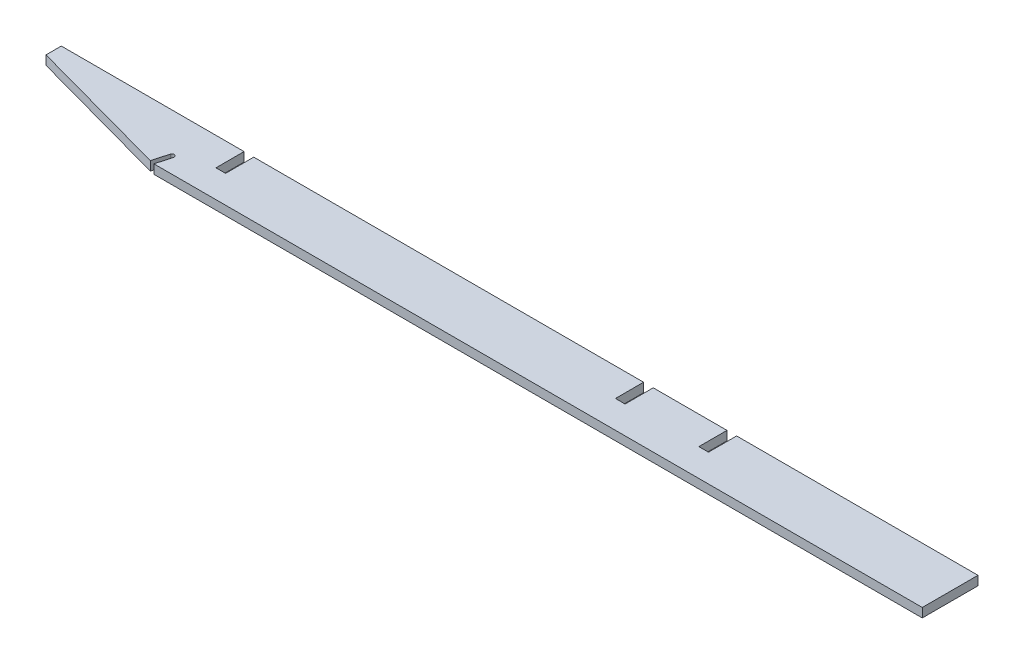
ISO-10303-21;
HEADER;
FILE_DESCRIPTION(('STEP AP214'),'2;1');
FILE_NAME('part.step','',(''),(''),'','','');
FILE_SCHEMA(('AUTOMOTIVE_DESIGN { 1 0 10303 214 1 1 1 1 }'));
ENDSEC;
DATA;
#1=APPLICATION_CONTEXT('core data for automotive mechanical design processes');
#2=APPLICATION_PROTOCOL_DEFINITION('international standard','automotive_design',2000,#1);
#3=PRODUCT_CONTEXT('',#1,'mechanical');
#4=PRODUCT('Part','Part','',(#3));
#5=PRODUCT_RELATED_PRODUCT_CATEGORY('part','',(#4));
#6=PRODUCT_DEFINITION_FORMATION('','',#4);
#7=PRODUCT_DEFINITION_CONTEXT('part definition',#1,'design');
#8=PRODUCT_DEFINITION('design','',#6,#7);
#9=PRODUCT_DEFINITION_SHAPE('','',#8);
#10=(LENGTH_UNIT() NAMED_UNIT(*) SI_UNIT(.MILLI.,.METRE.));
#11=(NAMED_UNIT(*) PLANE_ANGLE_UNIT() SI_UNIT($,.RADIAN.));
#12=(NAMED_UNIT(*) SI_UNIT($,.STERADIAN.) SOLID_ANGLE_UNIT());
#13=UNCERTAINTY_MEASURE_WITH_UNIT(LENGTH_MEASURE(1.E-05),#10,'distance_accuracy_value','');
#14=(GEOMETRIC_REPRESENTATION_CONTEXT(3) GLOBAL_UNCERTAINTY_ASSIGNED_CONTEXT((#13)) GLOBAL_UNIT_ASSIGNED_CONTEXT((#10,
#11,#12)) REPRESENTATION_CONTEXT('',''));
#15=CARTESIAN_POINT('',(0.,0.,0.));
#16=DIRECTION('',(0.,0.,1.));
#17=DIRECTION('',(1.,0.,0.));
#18=AXIS2_PLACEMENT_3D('',#15,#16,#17);
#19=CARTESIAN_POINT('',(-1457.76984888733,841.502,38.1));
#20=DIRECTION('',(-0.26471698178117,0.,0.964326147917118));
#21=DIRECTION('',(0.964326147917118,0.,0.26471698178117));
#22=AXIS2_PLACEMENT_3D('',#19,#20,#21);
#23=PLANE('',#22);
#24=DIRECTION('',(0.964326147917118,0.,0.26471698178117));
#25=VECTOR('',#24,1.);
#26=CARTESIAN_POINT('',(-1457.76984888733,841.502,38.1));
#27=LINE('',#26,#25);
#28=CARTESIAN_POINT('',(-1520.36270603019,841.502,20.9176470588235));
#29=VERTEX_POINT('',#28);
#30=CARTESIAN_POINT('',(-1323.73398806948,841.502,74.8941578715673));
#31=VERTEX_POINT('',#30);
#32=EDGE_CURVE('E296',#29,#31,#27,.T.);
#33=ORIENTED_EDGE('',*,*,#32,.T.);
#34=DIRECTION('',(0.,1.,0.));
#35=VECTOR('',#34,1.);
#36=CARTESIAN_POINT('',(-1323.73398806948,-2244.13415908109,74.8941578715673));
#37=LINE('',#36,#35);
#38=CARTESIAN_POINT('',(-1323.73398806948,853.948,74.8941578715673));
#39=VERTEX_POINT('',#38);
#40=EDGE_CURVE('E199',#31,#39,#37,.T.);
#41=ORIENTED_EDGE('',*,*,#40,.T.);
#42=DIRECTION('',(0.964326147917118,0.,0.26471698178117));
#43=VECTOR('',#42,1.);
#44=CARTESIAN_POINT('',(-1457.76984888733,853.948,38.1));
#45=LINE('',#44,#43);
#46=CARTESIAN_POINT('',(-1520.36270603019,853.948,20.9176470588235));
#47=VERTEX_POINT('',#46);
#48=EDGE_CURVE('E295',#47,#39,#45,.T.);
#49=ORIENTED_EDGE('',*,*,#48,.F.);
#50=DIRECTION('',(0.,-1.,0.));
#51=VECTOR('',#50,1.);
#52=CARTESIAN_POINT('',(-1520.36270603019,841.502,20.9176470588235));
#53=LINE('',#52,#51);
#54=EDGE_CURVE('E47',#47,#29,#53,.T.);
#55=ORIENTED_EDGE('',*,*,#54,.T.);
#56=EDGE_LOOP('',(#33,#41,#49,#55));
#57=FACE_BOUND('',#56,.T.);
#58=ADVANCED_FACE('F14',(#57),#23,.T.);
#59=CARTESIAN_POINT('',(-269.875,841.502,76.2));
#60=DIRECTION('',(0.,0.,-1.));
#61=DIRECTION('',(-1.,0.,0.));
#62=AXIS2_PLACEMENT_3D('',#59,#60,#61);
#63=PLANE('',#62);
#64=DIRECTION('',(0.,1.,0.));
#65=VECTOR('',#64,1.);
#66=CARTESIAN_POINT('',(-1317.50754546389,841.502,76.2));
#67=LINE('',#66,#65);
#68=CARTESIAN_POINT('',(-1317.50754546389,841.502,76.2));
#69=VERTEX_POINT('',#68);
#70=CARTESIAN_POINT('',(-1317.50754546389,853.948,76.2));
#71=VERTEX_POINT('',#70);
#72=EDGE_CURVE('E219',#69,#71,#67,.T.);
#73=ORIENTED_EDGE('',*,*,#72,.F.);
#74=DIRECTION('',(-1.,0.,0.));
#75=VECTOR('',#74,1.);
#76=CARTESIAN_POINT('',(-269.875,841.502,76.2));
#77=LINE('',#76,#75);
#78=CARTESIAN_POINT('',(-266.7,841.502,76.2));
#79=VERTEX_POINT('',#78);
#80=EDGE_CURVE('E310',#79,#69,#77,.T.);
#81=ORIENTED_EDGE('',*,*,#80,.F.);
#82=DIRECTION('',(0.,1.,0.));
#83=VECTOR('',#82,1.);
#84=CARTESIAN_POINT('',(-266.7,841.502,76.2));
#85=LINE('',#84,#83);
#86=CARTESIAN_POINT('',(-266.7,853.948,76.2));
#87=VERTEX_POINT('',#86);
#88=EDGE_CURVE('E313',#79,#87,#85,.T.);
#89=ORIENTED_EDGE('',*,*,#88,.T.);
#90=DIRECTION('',(-1.,0.,0.));
#91=VECTOR('',#90,1.);
#92=CARTESIAN_POINT('',(-269.875,853.948,76.2));
#93=LINE('',#92,#91);
#94=EDGE_CURVE('E300',#87,#71,#93,.T.);
#95=ORIENTED_EDGE('',*,*,#94,.T.);
#96=EDGE_LOOP('',(#73,#81,#89,#95));
#97=FACE_BOUND('',#96,.T.);
#98=ADVANCED_FACE('F402',(#97),#63,.F.);
#99=CARTESIAN_POINT('',(-931.631353015096,841.502,38.1));
#100=DIRECTION('',(0.,-1.,0.));
#101=DIRECTION('',(1.,0.,0.));
#102=AXIS2_PLACEMENT_3D('',#99,#100,#101);
#103=PLANE('',#102);
#104=ORIENTED_EDGE('',*,*,#80,.T.);
#105=DIRECTION('',(0.26471698178117,0.,-0.964326147917118));
#106=VECTOR('',#105,1.);
#107=CARTESIAN_POINT('',(-1280.74131960763,841.502,-57.7341084763812));
#108=LINE('',#107,#106);
#109=CARTESIAN_POINT('',(-1311.72718211012,841.502,55.1429620684198));
#110=VERTEX_POINT('',#109);
#111=EDGE_CURVE('E217',#69,#110,#108,.T.);
#112=ORIENTED_EDGE('',*,*,#111,.T.);
#113=CARTESIAN_POINT('',(-1314.78891762976,841.502,54.3024856512645));
#114=DIRECTION('',(0.,-1.,0.));
#115=DIRECTION('',(0.,0.,-1.));
#116=AXIS2_PLACEMENT_3D('',#113,#114,#115);
#117=CIRCLE('',#116,3.175);
#118=CARTESIAN_POINT('',(-1317.8506531494,841.502,53.4620092341093));
#119=VERTEX_POINT('',#118);
#120=EDGE_CURVE('E203',#119,#110,#117,.T.);
#121=ORIENTED_EDGE('',*,*,#120,.F.);
#122=DIRECTION('',(0.26471698178117,0.,-0.964326147917118));
#123=VECTOR('',#122,1.);
#124=CARTESIAN_POINT('',(-1286.8647906469,841.502,-59.4150613106916));
#125=LINE('',#124,#123);
#126=EDGE_CURVE('E196',#31,#119,#125,.T.);
#127=ORIENTED_EDGE('',*,*,#126,.F.);
#128=ORIENTED_EDGE('',*,*,#32,.F.);
#129=DIRECTION('',(0.,0.,1.));
#130=VECTOR('',#129,1.);
#131=CARTESIAN_POINT('',(-1520.36270603019,841.502,38.1));
#132=LINE('',#131,#130);
#133=CARTESIAN_POINT('',(-1520.36270603019,841.502,0.));
#134=VERTEX_POINT('',#133);
#135=EDGE_CURVE('E380',#29,#134,#132,.F.);
#136=ORIENTED_EDGE('',*,*,#135,.T.);
#137=DIRECTION('',(-1.,0.,0.));
#138=VECTOR('',#137,1.);
#139=CARTESIAN_POINT('',(-931.631353015096,841.502,0.));
#140=LINE('',#139,#138);
#141=CARTESIAN_POINT('',(-1270.381,841.502,0.));
#142=VERTEX_POINT('',#141);
#143=EDGE_CURVE('E299',#142,#134,#140,.T.);
#144=ORIENTED_EDGE('',*,*,#143,.F.);
#145=DIRECTION('',(0.,0.,-1.));
#146=VECTOR('',#145,1.);
#147=CARTESIAN_POINT('',(-1270.381,841.502,38.1));
#148=LINE('',#147,#146);
#149=CARTESIAN_POINT('',(-1270.381,841.502,38.481));
#150=VERTEX_POINT('',#149);
#151=EDGE_CURVE('E262',#150,#142,#148,.T.);
#152=ORIENTED_EDGE('',*,*,#151,.F.);
#153=DIRECTION('',(-1.,0.,0.));
#154=VECTOR('',#153,1.);
#155=CARTESIAN_POINT('',(-931.631353015096,841.502,38.481));
#156=LINE('',#155,#154);
#157=CARTESIAN_POINT('',(-1257.173,841.502,38.481));
#158=VERTEX_POINT('',#157);
#159=EDGE_CURVE('E256',#158,#150,#156,.T.);
#160=ORIENTED_EDGE('',*,*,#159,.F.);
#161=DIRECTION('',(0.,0.,1.));
#162=VECTOR('',#161,1.);
#163=CARTESIAN_POINT('',(-1257.173,841.502,38.1));
#164=LINE('',#163,#162);
#165=CARTESIAN_POINT('',(-1257.173,841.502,0.));
#166=VERTEX_POINT('',#165);
#167=EDGE_CURVE('E253',#166,#158,#164,.T.);
#168=ORIENTED_EDGE('',*,*,#167,.F.);
#169=CARTESIAN_POINT('',(-724.027,841.502,0.));
#170=VERTEX_POINT('',#169);
#171=EDGE_CURVE('E455',#170,#166,#140,.T.);
#172=ORIENTED_EDGE('',*,*,#171,.F.);
#173=DIRECTION('',(0.,0.,-1.));
#174=VECTOR('',#173,1.);
#175=CARTESIAN_POINT('',(-724.027,841.502,38.1));
#176=LINE('',#175,#174);
#177=CARTESIAN_POINT('',(-724.027,841.502,38.481));
#178=VERTEX_POINT('',#177);
#179=EDGE_CURVE('E277',#178,#170,#176,.T.);
#180=ORIENTED_EDGE('',*,*,#179,.F.);
#181=DIRECTION('',(-1.,0.,0.));
#182=VECTOR('',#181,1.);
#183=CARTESIAN_POINT('',(-931.631353015096,841.502,38.481));
#184=LINE('',#183,#182);
#185=CARTESIAN_POINT('',(-710.819,841.502,38.481));
#186=VERTEX_POINT('',#185);
#187=EDGE_CURVE('E271',#186,#178,#184,.T.);
#188=ORIENTED_EDGE('',*,*,#187,.F.);
#189=DIRECTION('',(0.,0.,1.));
#190=VECTOR('',#189,1.);
#191=CARTESIAN_POINT('',(-710.819,841.502,38.1));
#192=LINE('',#191,#190);
#193=CARTESIAN_POINT('',(-710.819,841.502,0.));
#194=VERTEX_POINT('',#193);
#195=EDGE_CURVE('E268',#194,#186,#192,.T.);
#196=ORIENTED_EDGE('',*,*,#195,.F.);
#197=CARTESIAN_POINT('',(-609.981,841.502,0.));
#198=VERTEX_POINT('',#197);
#199=EDGE_CURVE('E306',#198,#194,#140,.T.);
#200=ORIENTED_EDGE('',*,*,#199,.F.);
#201=DIRECTION('',(0.,0.,-1.));
#202=VECTOR('',#201,1.);
#203=CARTESIAN_POINT('',(-609.981,841.502,38.1));
#204=LINE('',#203,#202);
#205=CARTESIAN_POINT('',(-609.981,841.502,38.481));
#206=VERTEX_POINT('',#205);
#207=EDGE_CURVE('E283',#206,#198,#204,.T.);
#208=ORIENTED_EDGE('',*,*,#207,.F.);
#209=DIRECTION('',(-1.,0.,0.));
#210=VECTOR('',#209,1.);
#211=CARTESIAN_POINT('',(-931.631353015096,841.502,38.481));
#212=LINE('',#211,#210);
#213=CARTESIAN_POINT('',(-596.773,841.502,38.481));
#214=VERTEX_POINT('',#213);
#215=EDGE_CURVE('E292',#214,#206,#212,.T.);
#216=ORIENTED_EDGE('',*,*,#215,.F.);
#217=DIRECTION('',(0.,0.,1.));
#218=VECTOR('',#217,1.);
#219=CARTESIAN_POINT('',(-596.773,841.502,38.1));
#220=LINE('',#219,#218);
#221=CARTESIAN_POINT('',(-596.773,841.502,0.));
#222=VERTEX_POINT('',#221);
#223=EDGE_CURVE('E289',#222,#214,#220,.T.);
#224=ORIENTED_EDGE('',*,*,#223,.F.);
#225=CARTESIAN_POINT('',(-266.7,841.502,0.));
#226=VERTEX_POINT('',#225);
#227=EDGE_CURVE('E301',#226,#222,#140,.T.);
#228=ORIENTED_EDGE('',*,*,#227,.F.);
#229=DIRECTION('',(0.,0.,-1.));
#230=VECTOR('',#229,1.);
#231=CARTESIAN_POINT('',(-266.7,841.502,38.1));
#232=LINE('',#231,#230);
#233=EDGE_CURVE('E305',#79,#226,#232,.T.);
#234=ORIENTED_EDGE('',*,*,#233,.F.);
#235=EDGE_LOOP('',(#104,#112,#121,#127,#128,#136,#144,#152,#160,#168,#172,#180,#188,#196,#200,
#208,#216,#224,#228,#234));
#236=FACE_BOUND('',#235,.T.);
#237=ADVANCED_FACE('F216',(#236),#103,.T.);
#238=CARTESIAN_POINT('',(-931.631353015096,853.948,38.1));
#239=DIRECTION('',(0.,-1.,0.));
#240=DIRECTION('',(1.,0.,0.));
#241=AXIS2_PLACEMENT_3D('',#238,#239,#240);
#242=PLANE('',#241);
#243=DIRECTION('',(0.26471698178117,0.,-0.964326147917118));
#244=VECTOR('',#243,1.);
#245=CARTESIAN_POINT('',(-1280.74131960763,853.948,-57.7341084763812));
#246=LINE('',#245,#244);
#247=CARTESIAN_POINT('',(-1311.72718211012,853.948,55.1429620684198));
#248=VERTEX_POINT('',#247);
#249=EDGE_CURVE('E9',#71,#248,#246,.T.);
#250=ORIENTED_EDGE('',*,*,#249,.F.);
#251=ORIENTED_EDGE('',*,*,#94,.F.);
#252=DIRECTION('',(0.,0.,-1.));
#253=VECTOR('',#252,1.);
#254=CARTESIAN_POINT('',(-266.7,853.948,38.1));
#255=LINE('',#254,#253);
#256=CARTESIAN_POINT('',(-266.7,853.948,0.));
#257=VERTEX_POINT('',#256);
#258=EDGE_CURVE('E322',#87,#257,#255,.T.);
#259=ORIENTED_EDGE('',*,*,#258,.T.);
#260=DIRECTION('',(-1.,0.,0.));
#261=VECTOR('',#260,1.);
#262=CARTESIAN_POINT('',(-931.631353015096,853.948,0.));
#263=LINE('',#262,#261);
#264=CARTESIAN_POINT('',(-596.773,853.948,0.));
#265=VERTEX_POINT('',#264);
#266=EDGE_CURVE('E318',#257,#265,#263,.T.);
#267=ORIENTED_EDGE('',*,*,#266,.T.);
#268=DIRECTION('',(0.,0.,1.));
#269=VECTOR('',#268,1.);
#270=CARTESIAN_POINT('',(-596.773,853.948,38.1));
#271=LINE('',#270,#269);
#272=CARTESIAN_POINT('',(-596.773,853.948,38.481));
#273=VERTEX_POINT('',#272);
#274=EDGE_CURVE('E367',#265,#273,#271,.T.);
#275=ORIENTED_EDGE('',*,*,#274,.T.);
#276=DIRECTION('',(-1.,0.,0.));
#277=VECTOR('',#276,1.);
#278=CARTESIAN_POINT('',(-931.631353015096,853.948,38.481));
#279=LINE('',#278,#277);
#280=CARTESIAN_POINT('',(-609.981,853.948,38.481));
#281=VERTEX_POINT('',#280);
#282=EDGE_CURVE('E363',#273,#281,#279,.T.);
#283=ORIENTED_EDGE('',*,*,#282,.T.);
#284=DIRECTION('',(0.,0.,-1.));
#285=VECTOR('',#284,1.);
#286=CARTESIAN_POINT('',(-609.981,853.948,38.1));
#287=LINE('',#286,#285);
#288=CARTESIAN_POINT('',(-609.981,853.948,0.));
#289=VERTEX_POINT('',#288);
#290=EDGE_CURVE('E359',#281,#289,#287,.T.);
#291=ORIENTED_EDGE('',*,*,#290,.T.);
#292=CARTESIAN_POINT('',(-710.819,853.948,0.));
#293=VERTEX_POINT('',#292);
#294=EDGE_CURVE('E323',#289,#293,#263,.T.);
#295=ORIENTED_EDGE('',*,*,#294,.T.);
#296=DIRECTION('',(0.,0.,1.));
#297=VECTOR('',#296,1.);
#298=CARTESIAN_POINT('',(-710.819,853.948,38.1));
#299=LINE('',#298,#297);
#300=CARTESIAN_POINT('',(-710.819,853.948,38.481));
#301=VERTEX_POINT('',#300);
#302=EDGE_CURVE('E347',#293,#301,#299,.T.);
#303=ORIENTED_EDGE('',*,*,#302,.T.);
#304=DIRECTION('',(-1.,0.,0.));
#305=VECTOR('',#304,1.);
#306=CARTESIAN_POINT('',(-931.631353015096,853.948,38.481));
#307=LINE('',#306,#305);
#308=CARTESIAN_POINT('',(-724.027,853.948,38.481));
#309=VERTEX_POINT('',#308);
#310=EDGE_CURVE('E351',#301,#309,#307,.T.);
#311=ORIENTED_EDGE('',*,*,#310,.T.);
#312=DIRECTION('',(0.,0.,-1.));
#313=VECTOR('',#312,1.);
#314=CARTESIAN_POINT('',(-724.027,853.948,38.1));
#315=LINE('',#314,#313);
#316=CARTESIAN_POINT('',(-724.027,853.948,0.));
#317=VERTEX_POINT('',#316);
#318=EDGE_CURVE('E355',#309,#317,#315,.T.);
#319=ORIENTED_EDGE('',*,*,#318,.T.);
#320=CARTESIAN_POINT('',(-1257.173,853.948,0.));
#321=VERTEX_POINT('',#320);
#322=EDGE_CURVE('E432',#317,#321,#263,.T.);
#323=ORIENTED_EDGE('',*,*,#322,.T.);
#324=DIRECTION('',(0.,0.,1.));
#325=VECTOR('',#324,1.);
#326=CARTESIAN_POINT('',(-1257.173,853.948,38.1));
#327=LINE('',#326,#325);
#328=CARTESIAN_POINT('',(-1257.173,853.948,38.481));
#329=VERTEX_POINT('',#328);
#330=EDGE_CURVE('E335',#321,#329,#327,.T.);
#331=ORIENTED_EDGE('',*,*,#330,.T.);
#332=DIRECTION('',(-1.,0.,0.));
#333=VECTOR('',#332,1.);
#334=CARTESIAN_POINT('',(-931.631353015096,853.948,38.481));
#335=LINE('',#334,#333);
#336=CARTESIAN_POINT('',(-1270.381,853.948,38.481));
#337=VERTEX_POINT('',#336);
#338=EDGE_CURVE('E339',#329,#337,#335,.T.);
#339=ORIENTED_EDGE('',*,*,#338,.T.);
#340=DIRECTION('',(0.,0.,-1.));
#341=VECTOR('',#340,1.);
#342=CARTESIAN_POINT('',(-1270.381,853.948,38.1));
#343=LINE('',#342,#341);
#344=CARTESIAN_POINT('',(-1270.381,853.948,0.));
#345=VERTEX_POINT('',#344);
#346=EDGE_CURVE('E343',#337,#345,#343,.T.);
#347=ORIENTED_EDGE('',*,*,#346,.T.);
#348=CARTESIAN_POINT('',(-1520.36270603019,853.948,0.));
#349=VERTEX_POINT('',#348);
#350=EDGE_CURVE('E317',#345,#349,#263,.T.);
#351=ORIENTED_EDGE('',*,*,#350,.T.);
#352=DIRECTION('',(0.,0.,-1.));
#353=VECTOR('',#352,1.);
#354=CARTESIAN_POINT('',(-1520.36270603019,853.948,0.));
#355=LINE('',#354,#353);
#356=EDGE_CURVE('E375',#349,#47,#355,.F.);
#357=ORIENTED_EDGE('',*,*,#356,.T.);
#358=ORIENTED_EDGE('',*,*,#48,.T.);
#359=DIRECTION('',(0.26471698178117,0.,-0.964326147917118));
#360=VECTOR('',#359,1.);
#361=CARTESIAN_POINT('',(-1286.8647906469,853.948,-59.4150613106916));
#362=LINE('',#361,#360);
#363=CARTESIAN_POINT('',(-1317.8506531494,853.948,53.4620092341093));
#364=VERTEX_POINT('',#363);
#365=EDGE_CURVE('E383',#39,#364,#362,.T.);
#366=ORIENTED_EDGE('',*,*,#365,.T.);
#367=CARTESIAN_POINT('',(-1314.78891762976,853.948,54.3024856512645));
#368=DIRECTION('',(0.,-1.,0.));
#369=DIRECTION('',(0.,0.,-1.));
#370=AXIS2_PLACEMENT_3D('',#367,#368,#369);
#371=CIRCLE('',#370,3.175);
#372=EDGE_CURVE('E23',#364,#248,#371,.T.);
#373=ORIENTED_EDGE('',*,*,#372,.T.);
#374=EDGE_LOOP('',(#250,#251,#259,#267,#275,#283,#291,#295,#303,#311,#319,#323,#331,#339,#347,
#351,#357,#358,#366,#373));
#375=FACE_BOUND('',#374,.T.);
#376=ADVANCED_FACE('F389',(#375),#242,.F.);
#377=CARTESIAN_POINT('',(-931.631353015096,841.502,0.));
#378=DIRECTION('',(0.,0.,-1.));
#379=DIRECTION('',(-1.,0.,0.));
#380=AXIS2_PLACEMENT_3D('',#377,#378,#379);
#381=PLANE('',#380);
#382=DIRECTION('',(0.,-1.,0.));
#383=VECTOR('',#382,1.);
#384=CARTESIAN_POINT('',(-596.773,841.502,0.));
#385=LINE('',#384,#383);
#386=EDGE_CURVE('E286',#265,#222,#385,.T.);
#387=ORIENTED_EDGE('',*,*,#386,.F.);
#388=ORIENTED_EDGE('',*,*,#266,.F.);
#389=DIRECTION('',(0.,1.,0.));
#390=VECTOR('',#389,1.);
#391=CARTESIAN_POINT('',(-266.7,841.502,0.));
#392=LINE('',#391,#390);
#393=EDGE_CURVE('E332',#226,#257,#392,.T.);
#394=ORIENTED_EDGE('',*,*,#393,.F.);
#395=ORIENTED_EDGE('',*,*,#227,.T.);
#396=EDGE_LOOP('',(#387,#388,#394,#395));
#397=FACE_BOUND('',#396,.T.);
#398=ADVANCED_FACE('F412',(#397),#381,.T.);
#399=DIRECTION('',(0.,1.,0.));
#400=VECTOR('',#399,1.);
#401=CARTESIAN_POINT('',(-724.027,841.502,0.));
#402=LINE('',#401,#400);
#403=EDGE_CURVE('E274',#170,#317,#402,.T.);
#404=ORIENTED_EDGE('',*,*,#403,.F.);
#405=ORIENTED_EDGE('',*,*,#171,.T.);
#406=DIRECTION('',(0.,-1.,0.));
#407=VECTOR('',#406,1.);
#408=CARTESIAN_POINT('',(-1257.173,841.502,0.));
#409=LINE('',#408,#407);
#410=EDGE_CURVE('E238',#321,#166,#409,.T.);
#411=ORIENTED_EDGE('',*,*,#410,.F.);
#412=ORIENTED_EDGE('',*,*,#322,.F.);
#413=EDGE_LOOP('',(#404,#405,#411,#412));
#414=FACE_BOUND('',#413,.T.);
#415=ADVANCED_FACE('F477',(#414),#381,.T.);
#416=ORIENTED_EDGE('',*,*,#143,.T.);
#417=DIRECTION('',(0.,1.,0.));
#418=VECTOR('',#417,1.);
#419=CARTESIAN_POINT('',(-1520.36270603019,841.502,0.));
#420=LINE('',#419,#418);
#421=EDGE_CURVE('E371',#134,#349,#420,.T.);
#422=ORIENTED_EDGE('',*,*,#421,.T.);
#423=ORIENTED_EDGE('',*,*,#350,.F.);
#424=DIRECTION('',(0.,1.,0.));
#425=VECTOR('',#424,1.);
#426=CARTESIAN_POINT('',(-1270.381,841.502,0.));
#427=LINE('',#426,#425);
#428=EDGE_CURVE('E259',#142,#345,#427,.T.);
#429=ORIENTED_EDGE('',*,*,#428,.F.);
#430=EDGE_LOOP('',(#416,#422,#423,#429));
#431=FACE_BOUND('',#430,.T.);
#432=ADVANCED_FACE('F448',(#431),#381,.T.);
#433=DIRECTION('',(0.,1.,0.));
#434=VECTOR('',#433,1.);
#435=CARTESIAN_POINT('',(-609.981,841.502,0.));
#436=LINE('',#435,#434);
#437=EDGE_CURVE('E280',#198,#289,#436,.T.);
#438=ORIENTED_EDGE('',*,*,#437,.F.);
#439=ORIENTED_EDGE('',*,*,#199,.T.);
#440=DIRECTION('',(0.,-1.,0.));
#441=VECTOR('',#440,1.);
#442=CARTESIAN_POINT('',(-710.819,841.502,0.));
#443=LINE('',#442,#441);
#444=EDGE_CURVE('E265',#293,#194,#443,.T.);
#445=ORIENTED_EDGE('',*,*,#444,.F.);
#446=ORIENTED_EDGE('',*,*,#294,.F.);
#447=EDGE_LOOP('',(#438,#439,#445,#446));
#448=FACE_BOUND('',#447,.T.);
#449=ADVANCED_FACE('F429',(#448),#381,.T.);
#450=CARTESIAN_POINT('',(-266.7,841.502,38.1));
#451=DIRECTION('',(1.,0.,0.));
#452=DIRECTION('',(0.,0.,-1.));
#453=AXIS2_PLACEMENT_3D('',#450,#451,#452);
#454=PLANE('',#453);
#455=ORIENTED_EDGE('',*,*,#258,.F.);
#456=ORIENTED_EDGE('',*,*,#88,.F.);
#457=ORIENTED_EDGE('',*,*,#233,.T.);
#458=ORIENTED_EDGE('',*,*,#393,.T.);
#459=EDGE_LOOP('',(#455,#456,#457,#458));
#460=FACE_BOUND('',#459,.T.);
#461=ADVANCED_FACE('F408',(#460),#454,.T.);
#462=CARTESIAN_POINT('',(-936.879,-2244.46058781173,38.481));
#463=DIRECTION('',(0.,0.,1.));
#464=DIRECTION('',(1.,0.,0.));
#465=AXIS2_PLACEMENT_3D('',#462,#463,#464);
#466=PLANE('',#465);
#467=ORIENTED_EDGE('',*,*,#159,.T.);
#468=DIRECTION('',(0.,1.,0.));
#469=VECTOR('',#468,1.);
#470=CARTESIAN_POINT('',(-1270.381,-2244.46058781173,38.481));
#471=LINE('',#470,#469);
#472=EDGE_CURVE('E242',#150,#337,#471,.T.);
#473=ORIENTED_EDGE('',*,*,#472,.T.);
#474=ORIENTED_EDGE('',*,*,#338,.F.);
#475=DIRECTION('',(0.,1.,0.));
#476=VECTOR('',#475,1.);
#477=CARTESIAN_POINT('',(-1257.173,-2244.46058781173,38.481));
#478=LINE('',#477,#476);
#479=EDGE_CURVE('E228',#158,#329,#478,.T.);
#480=ORIENTED_EDGE('',*,*,#479,.F.);
#481=EDGE_LOOP('',(#467,#473,#474,#480));
#482=FACE_BOUND('',#481,.T.);
#483=ADVANCED_FACE('F484',(#482),#466,.F.);
#484=CARTESIAN_POINT('',(-1270.381,-2244.46058781173,38.1));
#485=DIRECTION('',(-1.,0.,0.));
#486=DIRECTION('',(0.,0.,1.));
#487=AXIS2_PLACEMENT_3D('',#484,#485,#486);
#488=PLANE('',#487);
#489=ORIENTED_EDGE('',*,*,#151,.T.);
#490=ORIENTED_EDGE('',*,*,#428,.T.);
#491=ORIENTED_EDGE('',*,*,#346,.F.);
#492=ORIENTED_EDGE('',*,*,#472,.F.);
#493=EDGE_LOOP('',(#489,#490,#491,#492));
#494=FACE_BOUND('',#493,.T.);
#495=ADVANCED_FACE('F487',(#494),#488,.F.);
#496=CARTESIAN_POINT('',(-1257.173,-2244.46058781173,38.1));
#497=DIRECTION('',(1.,0.,0.));
#498=DIRECTION('',(0.,0.,-1.));
#499=AXIS2_PLACEMENT_3D('',#496,#497,#498);
#500=PLANE('',#499);
#501=ORIENTED_EDGE('',*,*,#167,.T.);
#502=ORIENTED_EDGE('',*,*,#479,.T.);
#503=ORIENTED_EDGE('',*,*,#330,.F.);
#504=ORIENTED_EDGE('',*,*,#410,.T.);
#505=EDGE_LOOP('',(#501,#502,#503,#504));
#506=FACE_BOUND('',#505,.T.);
#507=ADVANCED_FACE('F480',(#506),#500,.F.);
#508=CARTESIAN_POINT('',(-936.879,-2244.46058781173,38.481));
#509=DIRECTION('',(0.,0.,1.));
#510=DIRECTION('',(1.,0.,0.));
#511=AXIS2_PLACEMENT_3D('',#508,#509,#510);
#512=PLANE('',#511);
#513=ORIENTED_EDGE('',*,*,#187,.T.);
#514=DIRECTION('',(0.,1.,0.));
#515=VECTOR('',#514,1.);
#516=CARTESIAN_POINT('',(-724.027,-2244.46058781173,38.481));
#517=LINE('',#516,#515);
#518=EDGE_CURVE('E234',#178,#309,#517,.T.);
#519=ORIENTED_EDGE('',*,*,#518,.T.);
#520=ORIENTED_EDGE('',*,*,#310,.F.);
#521=DIRECTION('',(0.,1.,0.));
#522=VECTOR('',#521,1.);
#523=CARTESIAN_POINT('',(-710.819,-2244.46058781173,38.481));
#524=LINE('',#523,#522);
#525=EDGE_CURVE('E239',#186,#301,#524,.T.);
#526=ORIENTED_EDGE('',*,*,#525,.F.);
#527=EDGE_LOOP('',(#513,#519,#520,#526));
#528=FACE_BOUND('',#527,.T.);
#529=ADVANCED_FACE('F474',(#528),#512,.F.);
#530=CARTESIAN_POINT('',(-724.027,-2244.46058781173,38.1));
#531=DIRECTION('',(-1.,0.,0.));
#532=DIRECTION('',(0.,0.,1.));
#533=AXIS2_PLACEMENT_3D('',#530,#531,#532);
#534=PLANE('',#533);
#535=ORIENTED_EDGE('',*,*,#179,.T.);
#536=ORIENTED_EDGE('',*,*,#403,.T.);
#537=ORIENTED_EDGE('',*,*,#318,.F.);
#538=ORIENTED_EDGE('',*,*,#518,.F.);
#539=EDGE_LOOP('',(#535,#536,#537,#538));
#540=FACE_BOUND('',#539,.T.);
#541=ADVANCED_FACE('F574',(#540),#534,.F.);
#542=CARTESIAN_POINT('',(-710.819,-2244.46058781173,38.1));
#543=DIRECTION('',(1.,0.,0.));
#544=DIRECTION('',(0.,0.,-1.));
#545=AXIS2_PLACEMENT_3D('',#542,#543,#544);
#546=PLANE('',#545);
#547=ORIENTED_EDGE('',*,*,#195,.T.);
#548=ORIENTED_EDGE('',*,*,#525,.T.);
#549=ORIENTED_EDGE('',*,*,#302,.F.);
#550=ORIENTED_EDGE('',*,*,#444,.T.);
#551=EDGE_LOOP('',(#547,#548,#549,#550));
#552=FACE_BOUND('',#551,.T.);
#553=ADVANCED_FACE('F471',(#552),#546,.F.);
#554=CARTESIAN_POINT('',(-936.879,-2244.46058781173,38.481));
#555=DIRECTION('',(0.,0.,1.));
#556=DIRECTION('',(1.,0.,0.));
#557=AXIS2_PLACEMENT_3D('',#554,#555,#556);
#558=PLANE('',#557);
#559=ORIENTED_EDGE('',*,*,#215,.T.);
#560=DIRECTION('',(0.,1.,0.));
#561=VECTOR('',#560,1.);
#562=CARTESIAN_POINT('',(-609.981,-2244.46058781173,38.481));
#563=LINE('',#562,#561);
#564=EDGE_CURVE('E229',#206,#281,#563,.T.);
#565=ORIENTED_EDGE('',*,*,#564,.T.);
#566=ORIENTED_EDGE('',*,*,#282,.F.);
#567=DIRECTION('',(0.,1.,0.));
#568=VECTOR('',#567,1.);
#569=CARTESIAN_POINT('',(-596.773,-2244.46058781173,38.481));
#570=LINE('',#569,#568);
#571=EDGE_CURVE('E233',#214,#273,#570,.T.);
#572=ORIENTED_EDGE('',*,*,#571,.F.);
#573=EDGE_LOOP('',(#559,#565,#566,#572));
#574=FACE_BOUND('',#573,.T.);
#575=ADVANCED_FACE('F421',(#574),#558,.F.);
#576=CARTESIAN_POINT('',(-596.773,-2244.46058781173,38.1));
#577=DIRECTION('',(1.,0.,0.));
#578=DIRECTION('',(0.,0.,-1.));
#579=AXIS2_PLACEMENT_3D('',#576,#577,#578);
#580=PLANE('',#579);
#581=ORIENTED_EDGE('',*,*,#223,.T.);
#582=ORIENTED_EDGE('',*,*,#571,.T.);
#583=ORIENTED_EDGE('',*,*,#274,.F.);
#584=ORIENTED_EDGE('',*,*,#386,.T.);
#585=EDGE_LOOP('',(#581,#582,#583,#584));
#586=FACE_BOUND('',#585,.T.);
#587=ADVANCED_FACE('F414',(#586),#580,.F.);
#588=CARTESIAN_POINT('',(-609.981,-2244.46058781173,38.1));
#589=DIRECTION('',(-1.,0.,0.));
#590=DIRECTION('',(0.,0.,1.));
#591=AXIS2_PLACEMENT_3D('',#588,#589,#590);
#592=PLANE('',#591);
#593=ORIENTED_EDGE('',*,*,#207,.T.);
#594=ORIENTED_EDGE('',*,*,#437,.T.);
#595=ORIENTED_EDGE('',*,*,#290,.F.);
#596=ORIENTED_EDGE('',*,*,#564,.F.);
#597=EDGE_LOOP('',(#593,#594,#595,#596));
#598=FACE_BOUND('',#597,.T.);
#599=ADVANCED_FACE('F423',(#598),#592,.F.);
#600=CARTESIAN_POINT('',(-1520.36270603019,841.502,0.));
#601=DIRECTION('',(1.,0.,0.));
#602=DIRECTION('',(0.,1.,0.));
#603=AXIS2_PLACEMENT_3D('',#600,#601,#602);
#604=PLANE('',#603);
#605=ORIENTED_EDGE('',*,*,#135,.F.);
#606=ORIENTED_EDGE('',*,*,#54,.F.);
#607=ORIENTED_EDGE('',*,*,#356,.F.);
#608=ORIENTED_EDGE('',*,*,#421,.F.);
#609=EDGE_LOOP('',(#605,#606,#607,#608));
#610=FACE_BOUND('',#609,.T.);
#611=ADVANCED_FACE('F16',(#610),#604,.F.);
#612=CARTESIAN_POINT('',(-1314.78891762976,-2244.13415908109,54.3024856512645));
#613=DIRECTION('',(0.,1.,0.));
#614=DIRECTION('',(0.,0.,1.));
#615=AXIS2_PLACEMENT_3D('',#612,#613,#614);
#616=CYLINDRICAL_SURFACE('',#615,3.175);
#617=ORIENTED_EDGE('',*,*,#120,.T.);
#618=DIRECTION('',(0.,1.,0.));
#619=VECTOR('',#618,1.);
#620=CARTESIAN_POINT('',(-1311.72718211012,-2244.13415908109,55.1429620684198));
#621=LINE('',#620,#619);
#622=EDGE_CURVE('E204',#110,#248,#621,.T.);
#623=ORIENTED_EDGE('',*,*,#622,.T.);
#624=ORIENTED_EDGE('',*,*,#372,.F.);
#625=DIRECTION('',(0.,1.,0.));
#626=VECTOR('',#625,1.);
#627=CARTESIAN_POINT('',(-1317.8506531494,-2244.13415908109,53.4620092341093));
#628=LINE('',#627,#626);
#629=EDGE_CURVE('E35',#119,#364,#628,.T.);
#630=ORIENTED_EDGE('',*,*,#629,.F.);
#631=EDGE_LOOP('',(#617,#623,#624,#630));
#632=FACE_BOUND('',#631,.T.);
#633=ADVANCED_FACE('F207',(#632),#616,.F.);
#634=CARTESIAN_POINT('',(-1322.04912757286,-2244.13415908109,68.7564517767437));
#635=DIRECTION('',(-0.964326147917118,0.,-0.26471698178117));
#636=DIRECTION('',(-0.26471698178117,0.,0.964326147917118));
#637=AXIS2_PLACEMENT_3D('',#634,#635,#636);
#638=PLANE('',#637);
#639=ORIENTED_EDGE('',*,*,#126,.T.);
#640=ORIENTED_EDGE('',*,*,#629,.T.);
#641=ORIENTED_EDGE('',*,*,#365,.F.);
#642=ORIENTED_EDGE('',*,*,#40,.F.);
#643=EDGE_LOOP('',(#639,#640,#641,#642));
#644=FACE_BOUND('',#643,.T.);
#645=ADVANCED_FACE('F197',(#644),#638,.F.);
#646=CARTESIAN_POINT('',(-1314.05853794334,-2244.13415908109,63.6357583179992));
#647=DIRECTION('',(-0.964326147917118,0.,-0.26471698178117));
#648=DIRECTION('',(-0.26471698178117,0.,0.964326147917118));
#649=AXIS2_PLACEMENT_3D('',#646,#647,#648);
#650=PLANE('',#649);
#651=ORIENTED_EDGE('',*,*,#72,.T.);
#652=ORIENTED_EDGE('',*,*,#249,.T.);
#653=ORIENTED_EDGE('',*,*,#622,.F.);
#654=ORIENTED_EDGE('',*,*,#111,.F.);
#655=EDGE_LOOP('',(#651,#652,#653,#654));
#656=FACE_BOUND('',#655,.T.);
#657=ADVANCED_FACE('F398',(#656),#650,.T.);
#658=CLOSED_SHELL('',(#58,#98,#237,#376,#398,#415,#432,#449,#461,#483,#495,#507,#529,#541,#553,
#575,#587,#599,#611,#633,#645,#657));
#659=MANIFOLD_SOLID_BREP('B1',#658);
#660=ADVANCED_BREP_SHAPE_REPRESENTATION('',(#18,#659),#14);
#661=SHAPE_DEFINITION_REPRESENTATION(#9,#660);
ENDSEC;
END-ISO-10303-21;
